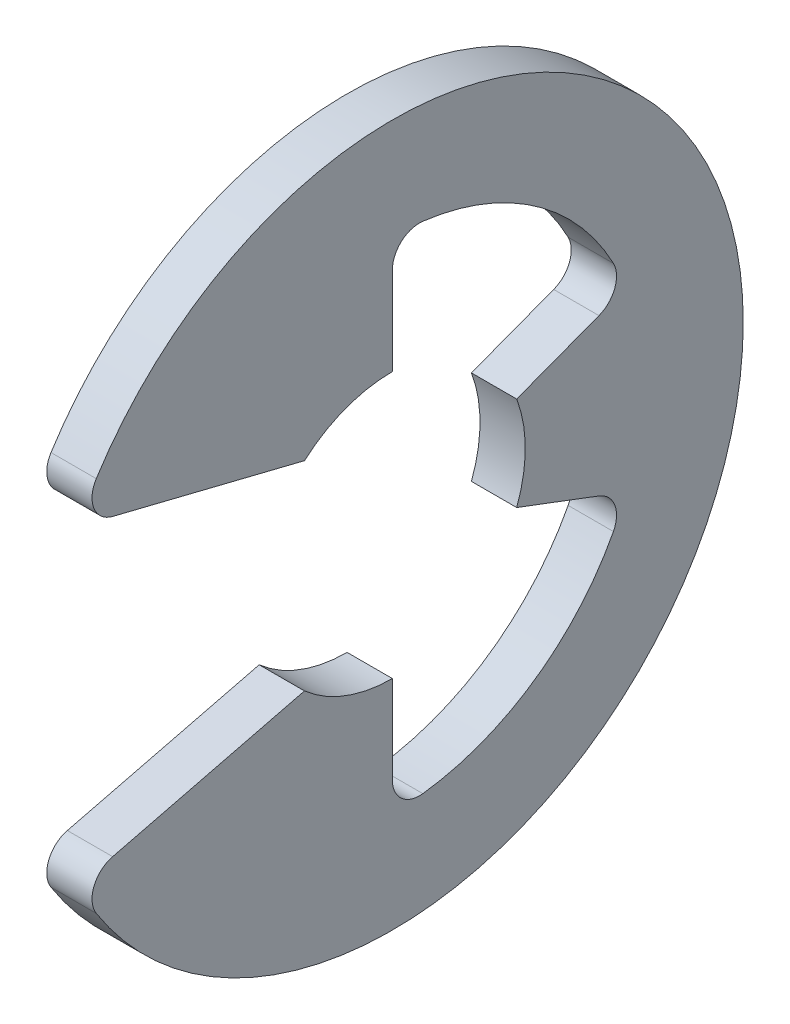
ISO-10303-21;
HEADER;
FILE_DESCRIPTION(('STEP AP214'),'2;1');
FILE_NAME('part.step','',(''),(''),'','','');
FILE_SCHEMA(('AUTOMOTIVE_DESIGN { 1 0 10303 214 1 1 1 1 }'));
ENDSEC;
DATA;
#1=APPLICATION_CONTEXT('core data for automotive mechanical design processes');
#2=APPLICATION_PROTOCOL_DEFINITION('international standard','automotive_design',2000,#1);
#3=PRODUCT_CONTEXT('',#1,'mechanical');
#4=PRODUCT('Part','Part','',(#3));
#5=PRODUCT_RELATED_PRODUCT_CATEGORY('part','',(#4));
#6=PRODUCT_DEFINITION_FORMATION('','',#4);
#7=PRODUCT_DEFINITION_CONTEXT('part definition',#1,'design');
#8=PRODUCT_DEFINITION('design','',#6,#7);
#9=PRODUCT_DEFINITION_SHAPE('','',#8);
#10=(LENGTH_UNIT() NAMED_UNIT(*) SI_UNIT(.MILLI.,.METRE.));
#11=(NAMED_UNIT(*) PLANE_ANGLE_UNIT() SI_UNIT($,.RADIAN.));
#12=(NAMED_UNIT(*) SI_UNIT($,.STERADIAN.) SOLID_ANGLE_UNIT());
#13=UNCERTAINTY_MEASURE_WITH_UNIT(LENGTH_MEASURE(1.E-05),#10,'distance_accuracy_value','');
#14=(GEOMETRIC_REPRESENTATION_CONTEXT(3) GLOBAL_UNCERTAINTY_ASSIGNED_CONTEXT((#13)) GLOBAL_UNIT_ASSIGNED_CONTEXT((#10,
#11,#12)) REPRESENTATION_CONTEXT('',''));
#15=CARTESIAN_POINT('',(0.,0.,0.));
#16=DIRECTION('',(0.,0.,1.));
#17=DIRECTION('',(1.,0.,0.));
#18=AXIS2_PLACEMENT_3D('',#15,#16,#17);
#19=CARTESIAN_POINT('',(0.35,0.,0.));
#20=DIRECTION('',(-1.,0.,0.));
#21=DIRECTION('',(0.,0.,1.));
#22=AXIS2_PLACEMENT_3D('',#19,#20,#21);
#23=CYLINDRICAL_SURFACE('',#22,5.425);
#24=CARTESIAN_POINT('',(0.35,0.,0.));
#25=DIRECTION('',(1.,0.,0.));
#26=DIRECTION('',(0.,0.,-1.));
#27=AXIS2_PLACEMENT_3D('',#24,#25,#26);
#28=CIRCLE('',#27,5.425);
#29=CARTESIAN_POINT('',(0.35,-2.91048609757391,4.57817602062535));
#30=VERTEX_POINT('',#29);
#31=CARTESIAN_POINT('',(0.35,2.91048609757391,4.57817602062535));
#32=VERTEX_POINT('',#31);
#33=EDGE_CURVE('E174',#30,#32,#28,.T.);
#34=ORIENTED_EDGE('',*,*,#33,.F.);
#35=DIRECTION('',(-1.,0.,0.));
#36=VECTOR('',#35,1.);
#37=CARTESIAN_POINT('',(0.35,-2.91048609757391,4.57817602062535));
#38=LINE('',#37,#36);
#39=CARTESIAN_POINT('',(-0.35,-2.91048609757391,4.57817602062535));
#40=VERTEX_POINT('',#39);
#41=EDGE_CURVE('E268',#30,#40,#38,.T.);
#42=ORIENTED_EDGE('',*,*,#41,.T.);
#43=CARTESIAN_POINT('',(-0.35,0.,0.));
#44=DIRECTION('',(1.,0.,0.));
#45=DIRECTION('',(0.,0.,-1.));
#46=AXIS2_PLACEMENT_3D('',#43,#44,#45);
#47=CIRCLE('',#46,5.425);
#48=CARTESIAN_POINT('',(-0.35,2.91048609757391,4.57817602062535));
#49=VERTEX_POINT('',#48);
#50=EDGE_CURVE('E212',#40,#49,#47,.T.);
#51=ORIENTED_EDGE('',*,*,#50,.T.);
#52=DIRECTION('',(-1.,0.,0.));
#53=VECTOR('',#52,1.);
#54=CARTESIAN_POINT('',(0.35,2.91048609757391,4.57817602062535));
#55=LINE('',#54,#53);
#56=EDGE_CURVE('E266',#49,#32,#55,.F.);
#57=ORIENTED_EDGE('',*,*,#56,.T.);
#58=EDGE_LOOP('',(#34,#42,#51,#57));
#59=FACE_BOUND('',#58,.T.);
#60=ADVANCED_FACE('F36',(#59),#23,.T.);
#61=CARTESIAN_POINT('',(0.35,2.41039731260291,4.86010388730495));
#62=DIRECTION('',(0.,0.970536829925373,-0.240952820606874));
#63=DIRECTION('',(0.,0.240952820606874,0.970536829925373));
#64=AXIS2_PLACEMENT_3D('',#61,#62,#63);
#65=PLANE('',#64);
#66=DIRECTION('',(0.,-0.240952820606874,-0.970536829925373));
#67=VECTOR('',#66,1.);
#68=CARTESIAN_POINT('',(0.35,2.41039731260291,4.86010388730495));
#69=LINE('',#68,#67);
#70=CARTESIAN_POINT('',(0.35,2.27753267306405,4.32493677142537));
#71=VERTEX_POINT('',#70);
#72=CARTESIAN_POINT('',(0.35,1.54125,1.35925473605943));
#73=VERTEX_POINT('',#72);
#74=EDGE_CURVE('E160',#71,#73,#69,.T.);
#75=ORIENTED_EDGE('',*,*,#74,.F.);
#76=DIRECTION('',(-1.,0.,0.));
#77=VECTOR('',#76,1.);
#78=CARTESIAN_POINT('',(0.35,2.27753267306405,4.32493677142537));
#79=LINE('',#78,#77);
#80=CARTESIAN_POINT('',(-0.35,2.27753267306405,4.32493677142537));
#81=VERTEX_POINT('',#80);
#82=EDGE_CURVE('E280',#71,#81,#79,.T.);
#83=ORIENTED_EDGE('',*,*,#82,.T.);
#84=DIRECTION('',(0.,-0.240952820606874,-0.970536829925373));
#85=VECTOR('',#84,1.);
#86=CARTESIAN_POINT('',(-0.35,2.41039731260291,4.86010388730495));
#87=LINE('',#86,#85);
#88=CARTESIAN_POINT('',(-0.35,1.54125,1.35925473605943));
#89=VERTEX_POINT('',#88);
#90=EDGE_CURVE('E180',#81,#89,#87,.T.);
#91=ORIENTED_EDGE('',*,*,#90,.T.);
#92=DIRECTION('',(-1.,0.,0.));
#93=VECTOR('',#92,1.);
#94=CARTESIAN_POINT('',(0.35,1.54125,1.35925473605943));
#95=LINE('',#94,#93);
#96=EDGE_CURVE('E177',#73,#89,#95,.T.);
#97=ORIENTED_EDGE('',*,*,#96,.F.);
#98=EDGE_LOOP('',(#75,#83,#91,#97));
#99=FACE_BOUND('',#98,.T.);
#100=ADVANCED_FACE('F178',(#99),#65,.F.);
#101=CARTESIAN_POINT('',(0.35,0.,0.));
#102=DIRECTION('',(-1.,0.,0.));
#103=DIRECTION('',(0.,0.,1.));
#104=AXIS2_PLACEMENT_3D('',#101,#102,#103);
#105=CYLINDRICAL_SURFACE('',#104,2.055);
#106=CARTESIAN_POINT('',(-0.35,0.,0.));
#107=DIRECTION('',(-1.,0.,0.));
#108=DIRECTION('',(0.,0.,1.));
#109=AXIS2_PLACEMENT_3D('',#106,#107,#108);
#110=CIRCLE('',#109,2.055);
#111=CARTESIAN_POINT('',(-0.35,2.055,0.));
#112=VERTEX_POINT('',#111);
#113=EDGE_CURVE('E216',#89,#112,#110,.T.);
#114=ORIENTED_EDGE('',*,*,#113,.T.);
#115=DIRECTION('',(-1.,0.,0.));
#116=VECTOR('',#115,1.);
#117=CARTESIAN_POINT('',(0.35,2.055,0.));
#118=LINE('',#117,#116);
#119=CARTESIAN_POINT('',(0.35,2.055,0.));
#120=VERTEX_POINT('',#119);
#121=EDGE_CURVE('E184',#120,#112,#118,.T.);
#122=ORIENTED_EDGE('',*,*,#121,.F.);
#123=CARTESIAN_POINT('',(0.35,0.,0.));
#124=DIRECTION('',(-1.,0.,0.));
#125=DIRECTION('',(0.,0.,1.));
#126=AXIS2_PLACEMENT_3D('',#123,#124,#125);
#127=CIRCLE('',#126,2.055);
#128=EDGE_CURVE('E166',#73,#120,#127,.T.);
#129=ORIENTED_EDGE('',*,*,#128,.F.);
#130=ORIENTED_EDGE('',*,*,#96,.T.);
#131=EDGE_LOOP('',(#114,#122,#129,#130));
#132=FACE_BOUND('',#131,.T.);
#133=ADVANCED_FACE('F186',(#132),#105,.F.);
#134=CARTESIAN_POINT('',(0.35,2.055,0.));
#135=DIRECTION('',(0.,0.,1.));
#136=DIRECTION('',(0.,-1.,0.));
#137=AXIS2_PLACEMENT_3D('',#134,#135,#136);
#138=PLANE('',#137);
#139=DIRECTION('',(0.,1.,0.));
#140=VECTOR('',#139,1.);
#141=CARTESIAN_POINT('',(-0.35,2.055,0.));
#142=LINE('',#141,#140);
#143=CARTESIAN_POINT('',(-0.35,3.41491421940735,0.));
#144=VERTEX_POINT('',#143);
#145=EDGE_CURVE('E218',#112,#144,#142,.T.);
#146=ORIENTED_EDGE('',*,*,#145,.T.);
#147=DIRECTION('',(1.,0.,0.));
#148=VECTOR('',#147,1.);
#149=CARTESIAN_POINT('',(0.35,3.41491421940735,0.));
#150=LINE('',#149,#148);
#151=CARTESIAN_POINT('',(0.35,3.41491421940735,0.));
#152=VERTEX_POINT('',#151);
#153=EDGE_CURVE('E264',#144,#152,#150,.T.);
#154=ORIENTED_EDGE('',*,*,#153,.T.);
#155=DIRECTION('',(0.,1.,0.));
#156=VECTOR('',#155,1.);
#157=CARTESIAN_POINT('',(0.35,2.055,0.));
#158=LINE('',#157,#156);
#159=EDGE_CURVE('E189',#120,#152,#158,.T.);
#160=ORIENTED_EDGE('',*,*,#159,.F.);
#161=ORIENTED_EDGE('',*,*,#121,.T.);
#162=EDGE_LOOP('',(#146,#154,#160,#161));
#163=FACE_BOUND('',#162,.T.);
#164=ADVANCED_FACE('F386',(#163),#138,.F.);
#165=CARTESIAN_POINT('',(0.35,0.,0.));
#166=DIRECTION('',(-1.,0.,0.));
#167=DIRECTION('',(0.,0.,1.));
#168=AXIS2_PLACEMENT_3D('',#165,#166,#167);
#169=CYLINDRICAL_SURFACE('',#168,3.86064516129032);
#170=CARTESIAN_POINT('',(0.35,0.,0.));
#171=DIRECTION('',(-1.,0.,0.));
#172=DIRECTION('',(0.,0.,-1.));
#173=AXIS2_PLACEMENT_3D('',#170,#171,#172);
#174=CIRCLE('',#173,3.86064516129032);
#175=CARTESIAN_POINT('',(0.35,3.83177324000255,-0.471269454340894));
#176=VERTEX_POINT('',#175);
#177=CARTESIAN_POINT('',(0.35,1.79556862973636,-3.4176767485093));
#178=VERTEX_POINT('',#177);
#179=EDGE_CURVE('E191',#176,#178,#174,.T.);
#180=ORIENTED_EDGE('',*,*,#179,.F.);
#181=DIRECTION('',(-1.,0.,0.));
#182=VECTOR('',#181,1.);
#183=CARTESIAN_POINT('',(0.35,3.83177324000255,-0.471269454340894));
#184=LINE('',#183,#182);
#185=CARTESIAN_POINT('',(-0.35,3.83177324000255,-0.471269454340894));
#186=VERTEX_POINT('',#185);
#187=EDGE_CURVE('E261',#176,#186,#184,.T.);
#188=ORIENTED_EDGE('',*,*,#187,.T.);
#189=CARTESIAN_POINT('',(-0.35,0.,0.));
#190=DIRECTION('',(-1.,0.,0.));
#191=DIRECTION('',(0.,0.,-1.));
#192=AXIS2_PLACEMENT_3D('',#189,#190,#191);
#193=CIRCLE('',#192,3.86064516129032);
#194=CARTESIAN_POINT('',(-0.35,1.79556862973636,-3.4176767485093));
#195=VERTEX_POINT('',#194);
#196=EDGE_CURVE('E221',#186,#195,#193,.T.);
#197=ORIENTED_EDGE('',*,*,#196,.T.);
#198=DIRECTION('',(-1.,0.,0.));
#199=VECTOR('',#198,1.);
#200=CARTESIAN_POINT('',(0.35,1.79556862973636,-3.4176767485093));
#201=LINE('',#200,#199);
#202=EDGE_CURVE('E259',#195,#178,#201,.F.);
#203=ORIENTED_EDGE('',*,*,#202,.T.);
#204=EDGE_LOOP('',(#180,#188,#197,#203));
#205=FACE_BOUND('',#204,.T.);
#206=ADVANCED_FACE('F308',(#205),#169,.F.);
#207=CARTESIAN_POINT('',(0.35,0.726552217669176,-1.92227648245511));
#208=DIRECTION('',(0.,-0.935414346693485,-0.353553390593275));
#209=DIRECTION('',(0.,0.353553390593275,-0.935414346693485));
#210=AXIS2_PLACEMENT_3D('',#207,#208,#209);
#211=PLANE('',#210);
#212=DIRECTION('',(0.,-0.353553390593275,0.935414346693485));
#213=VECTOR('',#212,1.);
#214=CARTESIAN_POINT('',(0.35,0.726552217669176,-1.92227648245511));
#215=LINE('',#214,#213);
#216=CARTESIAN_POINT('',(0.35,1.20735450085665,-3.19435975356122));
#217=VERTEX_POINT('',#216);
#218=CARTESIAN_POINT('',(0.35,0.726552217669177,-1.92227648245511));
#219=VERTEX_POINT('',#218);
#220=EDGE_CURVE('E196',#217,#219,#215,.T.);
#221=ORIENTED_EDGE('',*,*,#220,.F.);
#222=DIRECTION('',(1.,0.,0.));
#223=VECTOR('',#222,1.);
#224=CARTESIAN_POINT('',(-0.35,1.20735450085665,-3.19435975356122));
#225=LINE('',#224,#223);
#226=CARTESIAN_POINT('',(-0.35,1.20735450085665,-3.19435975356122));
#227=VERTEX_POINT('',#226);
#228=EDGE_CURVE('E283',#217,#227,#225,.F.);
#229=ORIENTED_EDGE('',*,*,#228,.T.);
#230=DIRECTION('',(0.,-0.353553390593275,0.935414346693485));
#231=VECTOR('',#230,1.);
#232=CARTESIAN_POINT('',(-0.35,0.726552217669176,-1.92227648245511));
#233=LINE('',#232,#231);
#234=CARTESIAN_POINT('',(-0.35,0.726552217669177,-1.92227648245511));
#235=VERTEX_POINT('',#234);
#236=EDGE_CURVE('E224',#227,#235,#233,.T.);
#237=ORIENTED_EDGE('',*,*,#236,.T.);
#238=DIRECTION('',(-1.,0.,0.));
#239=VECTOR('',#238,1.);
#240=CARTESIAN_POINT('',(0.35,0.726552217669177,-1.92227648245511));
#241=LINE('',#240,#239);
#242=EDGE_CURVE('E248',#219,#235,#241,.T.);
#243=ORIENTED_EDGE('',*,*,#242,.F.);
#244=EDGE_LOOP('',(#221,#229,#237,#243));
#245=FACE_BOUND('',#244,.T.);
#246=ADVANCED_FACE('F311',(#245),#211,.F.);
#247=CARTESIAN_POINT('',(0.35,0.,0.));
#248=DIRECTION('',(-1.,0.,0.));
#249=DIRECTION('',(0.,0.,1.));
#250=AXIS2_PLACEMENT_3D('',#247,#248,#249);
#251=CYLINDRICAL_SURFACE('',#250,2.055);
#252=CARTESIAN_POINT('',(-0.35,0.,0.));
#253=DIRECTION('',(-1.,0.,0.));
#254=DIRECTION('',(0.,0.,1.));
#255=AXIS2_PLACEMENT_3D('',#252,#253,#254);
#256=CIRCLE('',#255,2.055);
#257=CARTESIAN_POINT('',(-0.35,-0.726552217669176,-1.92227648245511));
#258=VERTEX_POINT('',#257);
#259=EDGE_CURVE('E226',#235,#258,#256,.T.);
#260=ORIENTED_EDGE('',*,*,#259,.T.);
#261=DIRECTION('',(-1.,0.,0.));
#262=VECTOR('',#261,1.);
#263=CARTESIAN_POINT('',(0.35,-0.726552217669176,-1.92227648245511));
#264=LINE('',#263,#262);
#265=CARTESIAN_POINT('',(0.35,-0.726552217669176,-1.92227648245511));
#266=VERTEX_POINT('',#265);
#267=EDGE_CURVE('E245',#266,#258,#264,.T.);
#268=ORIENTED_EDGE('',*,*,#267,.F.);
#269=CARTESIAN_POINT('',(0.35,0.,0.));
#270=DIRECTION('',(-1.,0.,0.));
#271=DIRECTION('',(0.,0.,1.));
#272=AXIS2_PLACEMENT_3D('',#269,#270,#271);
#273=CIRCLE('',#272,2.055);
#274=EDGE_CURVE('E198',#219,#266,#273,.T.);
#275=ORIENTED_EDGE('',*,*,#274,.F.);
#276=ORIENTED_EDGE('',*,*,#242,.T.);
#277=EDGE_LOOP('',(#260,#268,#275,#276));
#278=FACE_BOUND('',#277,.T.);
#279=ADVANCED_FACE('F317',(#278),#251,.F.);
#280=CARTESIAN_POINT('',(0.35,-0.726552217669176,-1.92227648245511));
#281=DIRECTION('',(0.,0.935414346693485,-0.353553390593275));
#282=DIRECTION('',(0.,0.353553390593275,0.935414346693485));
#283=AXIS2_PLACEMENT_3D('',#280,#281,#282);
#284=PLANE('',#283);
#285=DIRECTION('',(0.,-0.353553390593275,-0.935414346693485));
#286=VECTOR('',#285,1.);
#287=CARTESIAN_POINT('',(-0.35,-0.726552217669176,-1.92227648245511));
#288=LINE('',#287,#286);
#289=CARTESIAN_POINT('',(-0.35,-1.20735450085665,-3.19435975356122));
#290=VERTEX_POINT('',#289);
#291=EDGE_CURVE('E228',#258,#290,#288,.T.);
#292=ORIENTED_EDGE('',*,*,#291,.T.);
#293=DIRECTION('',(1.,0.,0.));
#294=VECTOR('',#293,1.);
#295=CARTESIAN_POINT('',(0.35,-1.20735450085665,-3.19435975356122));
#296=LINE('',#295,#294);
#297=CARTESIAN_POINT('',(0.35,-1.20735450085665,-3.19435975356122));
#298=VERTEX_POINT('',#297);
#299=EDGE_CURVE('E51',#290,#298,#296,.T.);
#300=ORIENTED_EDGE('',*,*,#299,.T.);
#301=DIRECTION('',(0.,-0.353553390593275,-0.935414346693485));
#302=VECTOR('',#301,1.);
#303=CARTESIAN_POINT('',(0.35,-0.726552217669176,-1.92227648245511));
#304=LINE('',#303,#302);
#305=EDGE_CURVE('E200',#266,#298,#304,.T.);
#306=ORIENTED_EDGE('',*,*,#305,.F.);
#307=ORIENTED_EDGE('',*,*,#267,.T.);
#308=EDGE_LOOP('',(#292,#300,#306,#307));
#309=FACE_BOUND('',#308,.T.);
#310=ADVANCED_FACE('F319',(#309),#284,.F.);
#311=CARTESIAN_POINT('',(0.35,0.,0.));
#312=DIRECTION('',(-1.,0.,0.));
#313=DIRECTION('',(0.,0.,1.));
#314=AXIS2_PLACEMENT_3D('',#311,#312,#313);
#315=CYLINDRICAL_SURFACE('',#314,3.86064516129032);
#316=CARTESIAN_POINT('',(-0.35,0.,0.));
#317=DIRECTION('',(-1.,0.,0.));
#318=DIRECTION('',(0.,0.,-1.));
#319=AXIS2_PLACEMENT_3D('',#316,#317,#318);
#320=CIRCLE('',#319,3.86064516129032);
#321=CARTESIAN_POINT('',(-0.35,-1.79556862973636,-3.4176767485093));
#322=VERTEX_POINT('',#321);
#323=CARTESIAN_POINT('',(-0.35,-3.83177324000255,-0.471269454340895));
#324=VERTEX_POINT('',#323);
#325=EDGE_CURVE('E230',#322,#324,#320,.T.);
#326=ORIENTED_EDGE('',*,*,#325,.T.);
#327=DIRECTION('',(-1.,0.,0.));
#328=VECTOR('',#327,1.);
#329=CARTESIAN_POINT('',(0.35,-3.83177324000255,-0.471269454340895));
#330=LINE('',#329,#328);
#331=CARTESIAN_POINT('',(0.35,-3.83177324000255,-0.471269454340895));
#332=VERTEX_POINT('',#331);
#333=EDGE_CURVE('E257',#324,#332,#330,.F.);
#334=ORIENTED_EDGE('',*,*,#333,.T.);
#335=CARTESIAN_POINT('',(0.35,0.,0.));
#336=DIRECTION('',(-1.,0.,0.));
#337=DIRECTION('',(0.,0.,-1.));
#338=AXIS2_PLACEMENT_3D('',#335,#336,#337);
#339=CIRCLE('',#338,3.86064516129032);
#340=CARTESIAN_POINT('',(0.35,-1.79556862973636,-3.4176767485093));
#341=VERTEX_POINT('',#340);
#342=EDGE_CURVE('E202',#341,#332,#339,.T.);
#343=ORIENTED_EDGE('',*,*,#342,.F.);
#344=DIRECTION('',(-1.,0.,0.));
#345=VECTOR('',#344,1.);
#346=CARTESIAN_POINT('',(0.35,-1.79556862973636,-3.4176767485093));
#347=LINE('',#346,#345);
#348=EDGE_CURVE('E254',#341,#322,#347,.T.);
#349=ORIENTED_EDGE('',*,*,#348,.T.);
#350=EDGE_LOOP('',(#326,#334,#343,#349));
#351=FACE_BOUND('',#350,.T.);
#352=ADVANCED_FACE('F321',(#351),#315,.F.);
#353=CARTESIAN_POINT('',(0.35,-2.055,0.));
#354=DIRECTION('',(0.,0.,1.));
#355=DIRECTION('',(0.,-1.,0.));
#356=AXIS2_PLACEMENT_3D('',#353,#354,#355);
#357=PLANE('',#356);
#358=DIRECTION('',(0.,1.,0.));
#359=VECTOR('',#358,1.);
#360=CARTESIAN_POINT('',(0.35,-2.055,0.));
#361=LINE('',#360,#359);
#362=CARTESIAN_POINT('',(0.35,-3.41491421940735,0.));
#363=VERTEX_POINT('',#362);
#364=CARTESIAN_POINT('',(0.35,-2.055,0.));
#365=VERTEX_POINT('',#364);
#366=EDGE_CURVE('E205',#363,#365,#361,.T.);
#367=ORIENTED_EDGE('',*,*,#366,.F.);
#368=DIRECTION('',(1.,0.,0.));
#369=VECTOR('',#368,1.);
#370=CARTESIAN_POINT('',(-0.35,-3.41491421940735,0.));
#371=LINE('',#370,#369);
#372=CARTESIAN_POINT('',(-0.35,-3.41491421940735,0.));
#373=VERTEX_POINT('',#372);
#374=EDGE_CURVE('E183',#363,#373,#371,.F.);
#375=ORIENTED_EDGE('',*,*,#374,.T.);
#376=DIRECTION('',(0.,1.,0.));
#377=VECTOR('',#376,1.);
#378=CARTESIAN_POINT('',(-0.35,-2.055,0.));
#379=LINE('',#378,#377);
#380=CARTESIAN_POINT('',(-0.35,-2.055,0.));
#381=VERTEX_POINT('',#380);
#382=EDGE_CURVE('E233',#373,#381,#379,.T.);
#383=ORIENTED_EDGE('',*,*,#382,.T.);
#384=DIRECTION('',(-1.,0.,0.));
#385=VECTOR('',#384,1.);
#386=CARTESIAN_POINT('',(0.35,-2.055,0.));
#387=LINE('',#386,#385);
#388=EDGE_CURVE('E242',#365,#381,#387,.T.);
#389=ORIENTED_EDGE('',*,*,#388,.F.);
#390=EDGE_LOOP('',(#367,#375,#383,#389));
#391=FACE_BOUND('',#390,.T.);
#392=ADVANCED_FACE('F327',(#391),#357,.F.);
#393=CARTESIAN_POINT('',(0.35,0.,0.));
#394=DIRECTION('',(-1.,0.,0.));
#395=DIRECTION('',(0.,0.,1.));
#396=AXIS2_PLACEMENT_3D('',#393,#394,#395);
#397=CYLINDRICAL_SURFACE('',#396,2.055);
#398=CARTESIAN_POINT('',(-0.35,0.,0.));
#399=DIRECTION('',(-1.,0.,0.));
#400=DIRECTION('',(0.,0.,-1.));
#401=AXIS2_PLACEMENT_3D('',#398,#399,#400);
#402=CIRCLE('',#401,2.055);
#403=CARTESIAN_POINT('',(-0.35,-1.54125,1.35925473605943));
#404=VERTEX_POINT('',#403);
#405=EDGE_CURVE('E235',#381,#404,#402,.T.);
#406=ORIENTED_EDGE('',*,*,#405,.T.);
#407=DIRECTION('',(-1.,0.,0.));
#408=VECTOR('',#407,1.);
#409=CARTESIAN_POINT('',(0.35,-1.54125,1.35925473605943));
#410=LINE('',#409,#408);
#411=CARTESIAN_POINT('',(0.35,-1.54125,1.35925473605943));
#412=VERTEX_POINT('',#411);
#413=EDGE_CURVE('E211',#412,#404,#410,.T.);
#414=ORIENTED_EDGE('',*,*,#413,.F.);
#415=CARTESIAN_POINT('',(0.35,0.,0.));
#416=DIRECTION('',(-1.,0.,0.));
#417=DIRECTION('',(0.,0.,-1.));
#418=AXIS2_PLACEMENT_3D('',#415,#416,#417);
#419=CIRCLE('',#418,2.055);
#420=EDGE_CURVE('E207',#365,#412,#419,.T.);
#421=ORIENTED_EDGE('',*,*,#420,.F.);
#422=ORIENTED_EDGE('',*,*,#388,.T.);
#423=EDGE_LOOP('',(#406,#414,#421,#422));
#424=FACE_BOUND('',#423,.T.);
#425=ADVANCED_FACE('F376',(#424),#397,.F.);
#426=CARTESIAN_POINT('',(0.35,-2.41039731260291,4.86010388730495));
#427=DIRECTION('',(0.,-0.970536829925373,-0.240952820606874));
#428=DIRECTION('',(0.,0.240952820606874,-0.970536829925373));
#429=AXIS2_PLACEMENT_3D('',#426,#427,#428);
#430=PLANE('',#429);
#431=DIRECTION('',(0.,-0.240952820606874,0.970536829925373));
#432=VECTOR('',#431,1.);
#433=CARTESIAN_POINT('',(-0.35,-2.41039731260291,4.86010388730495));
#434=LINE('',#433,#432);
#435=CARTESIAN_POINT('',(-0.35,-2.27753267306405,4.32493677142537));
#436=VERTEX_POINT('',#435);
#437=EDGE_CURVE('E237',#404,#436,#434,.T.);
#438=ORIENTED_EDGE('',*,*,#437,.T.);
#439=DIRECTION('',(-1.,0.,0.));
#440=VECTOR('',#439,1.);
#441=CARTESIAN_POINT('',(0.35,-2.27753267306405,4.32493677142537));
#442=LINE('',#441,#440);
#443=CARTESIAN_POINT('',(0.35,-2.27753267306405,4.32493677142537));
#444=VERTEX_POINT('',#443);
#445=EDGE_CURVE('E275',#436,#444,#442,.F.);
#446=ORIENTED_EDGE('',*,*,#445,.T.);
#447=DIRECTION('',(0.,-0.240952820606874,0.970536829925373));
#448=VECTOR('',#447,1.);
#449=CARTESIAN_POINT('',(0.35,-2.41039731260291,4.86010388730495));
#450=LINE('',#449,#448);
#451=EDGE_CURVE('E209',#412,#444,#450,.T.);
#452=ORIENTED_EDGE('',*,*,#451,.F.);
#453=ORIENTED_EDGE('',*,*,#413,.T.);
#454=EDGE_LOOP('',(#438,#446,#452,#453));
#455=FACE_BOUND('',#454,.T.);
#456=ADVANCED_FACE('F418',(#455),#430,.F.);
#457=CARTESIAN_POINT('',(0.35,0.,0.));
#458=DIRECTION('',(1.,0.,0.));
#459=DIRECTION('',(0.,0.,-1.));
#460=AXIS2_PLACEMENT_3D('',#457,#458,#459);
#461=PLANE('',#460);
#462=ORIENTED_EDGE('',*,*,#451,.T.);
#463=CARTESIAN_POINT('',(0.35,-2.6851581416327,4.22373658677049));
#464=DIRECTION('',(1.,0.,0.));
#465=DIRECTION('',(0.,0.,-1.));
#466=AXIS2_PLACEMENT_3D('',#463,#464,#465);
#467=CIRCLE('',#466,0.42);
#468=EDGE_CURVE('E278',#444,#30,#467,.T.);
#469=ORIENTED_EDGE('',*,*,#468,.T.);
#470=ORIENTED_EDGE('',*,*,#33,.T.);
#471=CARTESIAN_POINT('',(0.35,2.6851581416327,4.22373658677049));
#472=DIRECTION('',(1.,0.,0.));
#473=DIRECTION('',(0.,0.,-1.));
#474=AXIS2_PLACEMENT_3D('',#471,#472,#473);
#475=CIRCLE('',#474,0.42);
#476=EDGE_CURVE('E170',#32,#71,#475,.T.);
#477=ORIENTED_EDGE('',*,*,#476,.T.);
#478=ORIENTED_EDGE('',*,*,#74,.T.);
#479=ORIENTED_EDGE('',*,*,#128,.T.);
#480=ORIENTED_EDGE('',*,*,#159,.T.);
#481=CARTESIAN_POINT('',(0.35,3.41491421940735,-0.419999999999998));
#482=DIRECTION('',(1.,0.,0.));
#483=DIRECTION('',(0.,0.,-1.));
#484=AXIS2_PLACEMENT_3D('',#481,#482,#483);
#485=CIRCLE('',#484,0.42);
#486=EDGE_CURVE('E292',#152,#176,#485,.F.);
#487=ORIENTED_EDGE('',*,*,#486,.T.);
#488=ORIENTED_EDGE('',*,*,#179,.T.);
#489=CARTESIAN_POINT('',(0.35,1.60022852646792,-3.04586732951205));
#490=DIRECTION('',(1.,0.,0.));
#491=DIRECTION('',(0.,0.,-1.));
#492=AXIS2_PLACEMENT_3D('',#489,#490,#491);
#493=CIRCLE('',#492,0.42);
#494=EDGE_CURVE('E11',#178,#217,#493,.F.);
#495=ORIENTED_EDGE('',*,*,#494,.T.);
#496=ORIENTED_EDGE('',*,*,#220,.T.);
#497=ORIENTED_EDGE('',*,*,#274,.T.);
#498=ORIENTED_EDGE('',*,*,#305,.T.);
#499=CARTESIAN_POINT('',(0.35,-1.60022852646792,-3.04586732951205));
#500=DIRECTION('',(1.,0.,0.));
#501=DIRECTION('',(0.,0.,-1.));
#502=AXIS2_PLACEMENT_3D('',#499,#500,#501);
#503=CIRCLE('',#502,0.42);
#504=EDGE_CURVE('E296',#298,#341,#503,.F.);
#505=ORIENTED_EDGE('',*,*,#504,.T.);
#506=ORIENTED_EDGE('',*,*,#342,.T.);
#507=CARTESIAN_POINT('',(0.35,-3.41491421940735,-0.419999999999999));
#508=DIRECTION('',(1.,0.,0.));
#509=DIRECTION('',(0.,0.,-1.));
#510=AXIS2_PLACEMENT_3D('',#507,#508,#509);
#511=CIRCLE('',#510,0.42);
#512=EDGE_CURVE('E288',#332,#363,#511,.F.);
#513=ORIENTED_EDGE('',*,*,#512,.T.);
#514=ORIENTED_EDGE('',*,*,#366,.T.);
#515=ORIENTED_EDGE('',*,*,#420,.T.);
#516=EDGE_LOOP('',(#462,#469,#470,#477,#478,#479,#480,#487,#488,#495,#496,#497,#498,#505,#506,
#513,#514,#515));
#517=FACE_BOUND('',#516,.T.);
#518=ADVANCED_FACE('F163',(#517),#461,.T.);
#519=CARTESIAN_POINT('',(-0.35,0.,0.));
#520=DIRECTION('',(1.,0.,0.));
#521=DIRECTION('',(0.,0.,-1.));
#522=AXIS2_PLACEMENT_3D('',#519,#520,#521);
#523=PLANE('',#522);
#524=ORIENTED_EDGE('',*,*,#50,.F.);
#525=CARTESIAN_POINT('',(-0.35,-2.6851581416327,4.22373658677049));
#526=DIRECTION('',(1.,0.,0.));
#527=DIRECTION('',(0.,0.,-1.));
#528=AXIS2_PLACEMENT_3D('',#525,#526,#527);
#529=CIRCLE('',#528,0.42);
#530=EDGE_CURVE('E273',#40,#436,#529,.F.);
#531=ORIENTED_EDGE('',*,*,#530,.T.);
#532=ORIENTED_EDGE('',*,*,#437,.F.);
#533=ORIENTED_EDGE('',*,*,#405,.F.);
#534=ORIENTED_EDGE('',*,*,#382,.F.);
#535=CARTESIAN_POINT('',(-0.35,-3.41491421940735,-0.419999999999999));
#536=DIRECTION('',(1.,0.,0.));
#537=DIRECTION('',(0.,0.,-1.));
#538=AXIS2_PLACEMENT_3D('',#535,#536,#537);
#539=CIRCLE('',#538,0.42);
#540=EDGE_CURVE('E286',#373,#324,#539,.T.);
#541=ORIENTED_EDGE('',*,*,#540,.T.);
#542=ORIENTED_EDGE('',*,*,#325,.F.);
#543=CARTESIAN_POINT('',(-0.35,-1.60022852646792,-3.04586732951205));
#544=DIRECTION('',(1.,0.,0.));
#545=DIRECTION('',(0.,0.,-1.));
#546=AXIS2_PLACEMENT_3D('',#543,#544,#545);
#547=CIRCLE('',#546,0.42);
#548=EDGE_CURVE('E294',#322,#290,#547,.T.);
#549=ORIENTED_EDGE('',*,*,#548,.T.);
#550=ORIENTED_EDGE('',*,*,#291,.F.);
#551=ORIENTED_EDGE('',*,*,#259,.F.);
#552=ORIENTED_EDGE('',*,*,#236,.F.);
#553=CARTESIAN_POINT('',(-0.35,1.60022852646792,-3.04586732951205));
#554=DIRECTION('',(1.,0.,0.));
#555=DIRECTION('',(0.,0.,-1.));
#556=AXIS2_PLACEMENT_3D('',#553,#554,#555);
#557=CIRCLE('',#556,0.42);
#558=EDGE_CURVE('E44',#227,#195,#557,.T.);
#559=ORIENTED_EDGE('',*,*,#558,.T.);
#560=ORIENTED_EDGE('',*,*,#196,.F.);
#561=CARTESIAN_POINT('',(-0.35,3.41491421940735,-0.419999999999998));
#562=DIRECTION('',(1.,0.,0.));
#563=DIRECTION('',(0.,0.,-1.));
#564=AXIS2_PLACEMENT_3D('',#561,#562,#563);
#565=CIRCLE('',#564,0.42);
#566=EDGE_CURVE('E290',#186,#144,#565,.T.);
#567=ORIENTED_EDGE('',*,*,#566,.T.);
#568=ORIENTED_EDGE('',*,*,#145,.F.);
#569=ORIENTED_EDGE('',*,*,#113,.F.);
#570=ORIENTED_EDGE('',*,*,#90,.F.);
#571=CARTESIAN_POINT('',(-0.35,2.6851581416327,4.22373658677049));
#572=DIRECTION('',(1.,0.,0.));
#573=DIRECTION('',(0.,0.,-1.));
#574=AXIS2_PLACEMENT_3D('',#571,#572,#573);
#575=CIRCLE('',#574,0.42);
#576=EDGE_CURVE('E271',#81,#49,#575,.F.);
#577=ORIENTED_EDGE('',*,*,#576,.T.);
#578=EDGE_LOOP('',(#524,#531,#532,#533,#534,#541,#542,#549,#550,#551,#552,#559,#560,#567,#568,
#569,#570,#577));
#579=FACE_BOUND('',#578,.T.);
#580=ADVANCED_FACE('F301',(#579),#523,.F.);
#581=CARTESIAN_POINT('',(0.35,-3.41491421940735,-0.419999999999999));
#582=DIRECTION('',(-1.,0.,0.));
#583=DIRECTION('',(0.,0.,1.));
#584=AXIS2_PLACEMENT_3D('',#581,#582,#583);
#585=CYLINDRICAL_SURFACE('',#584,0.42);
#586=ORIENTED_EDGE('',*,*,#512,.F.);
#587=ORIENTED_EDGE('',*,*,#333,.F.);
#588=ORIENTED_EDGE('',*,*,#540,.F.);
#589=ORIENTED_EDGE('',*,*,#374,.F.);
#590=EDGE_LOOP('',(#586,#587,#588,#589));
#591=FACE_BOUND('',#590,.T.);
#592=ADVANCED_FACE('F341',(#591),#585,.F.);
#593=CARTESIAN_POINT('',(0.35,3.41491421940735,-0.419999999999998));
#594=DIRECTION('',(-1.,0.,0.));
#595=DIRECTION('',(0.,0.,1.));
#596=AXIS2_PLACEMENT_3D('',#593,#594,#595);
#597=CYLINDRICAL_SURFACE('',#596,0.42);
#598=ORIENTED_EDGE('',*,*,#486,.F.);
#599=ORIENTED_EDGE('',*,*,#153,.F.);
#600=ORIENTED_EDGE('',*,*,#566,.F.);
#601=ORIENTED_EDGE('',*,*,#187,.F.);
#602=EDGE_LOOP('',(#598,#599,#600,#601));
#603=FACE_BOUND('',#602,.T.);
#604=ADVANCED_FACE('F344',(#603),#597,.F.);
#605=CARTESIAN_POINT('',(0.35,-2.6851581416327,4.22373658677049));
#606=DIRECTION('',(-1.,0.,0.));
#607=DIRECTION('',(0.,0.,1.));
#608=AXIS2_PLACEMENT_3D('',#605,#606,#607);
#609=CYLINDRICAL_SURFACE('',#608,0.42);
#610=ORIENTED_EDGE('',*,*,#468,.F.);
#611=ORIENTED_EDGE('',*,*,#445,.F.);
#612=ORIENTED_EDGE('',*,*,#530,.F.);
#613=ORIENTED_EDGE('',*,*,#41,.F.);
#614=EDGE_LOOP('',(#610,#611,#612,#613));
#615=FACE_BOUND('',#614,.T.);
#616=ADVANCED_FACE('F348',(#615),#609,.T.);
#617=CARTESIAN_POINT('',(0.35,2.6851581416327,4.22373658677049));
#618=DIRECTION('',(-1.,0.,0.));
#619=DIRECTION('',(0.,0.,1.));
#620=AXIS2_PLACEMENT_3D('',#617,#618,#619);
#621=CYLINDRICAL_SURFACE('',#620,0.42);
#622=ORIENTED_EDGE('',*,*,#476,.F.);
#623=ORIENTED_EDGE('',*,*,#56,.F.);
#624=ORIENTED_EDGE('',*,*,#576,.F.);
#625=ORIENTED_EDGE('',*,*,#82,.F.);
#626=EDGE_LOOP('',(#622,#623,#624,#625));
#627=FACE_BOUND('',#626,.T.);
#628=ADVANCED_FACE('F352',(#627),#621,.T.);
#629=CARTESIAN_POINT('',(0.35,-1.60022852646792,-3.04586732951205));
#630=DIRECTION('',(-1.,0.,0.));
#631=DIRECTION('',(0.,0.,1.));
#632=AXIS2_PLACEMENT_3D('',#629,#630,#631);
#633=CYLINDRICAL_SURFACE('',#632,0.42);
#634=ORIENTED_EDGE('',*,*,#504,.F.);
#635=ORIENTED_EDGE('',*,*,#299,.F.);
#636=ORIENTED_EDGE('',*,*,#548,.F.);
#637=ORIENTED_EDGE('',*,*,#348,.F.);
#638=EDGE_LOOP('',(#634,#635,#636,#637));
#639=FACE_BOUND('',#638,.T.);
#640=ADVANCED_FACE('F355',(#639),#633,.F.);
#641=CARTESIAN_POINT('',(0.35,1.60022852646792,-3.04586732951205));
#642=DIRECTION('',(-1.,0.,0.));
#643=DIRECTION('',(0.,0.,1.));
#644=AXIS2_PLACEMENT_3D('',#641,#642,#643);
#645=CYLINDRICAL_SURFACE('',#644,0.42);
#646=ORIENTED_EDGE('',*,*,#494,.F.);
#647=ORIENTED_EDGE('',*,*,#202,.F.);
#648=ORIENTED_EDGE('',*,*,#558,.F.);
#649=ORIENTED_EDGE('',*,*,#228,.F.);
#650=EDGE_LOOP('',(#646,#647,#648,#649));
#651=FACE_BOUND('',#650,.T.);
#652=ADVANCED_FACE('F38',(#651),#645,.F.);
#653=CLOSED_SHELL('',(#60,#100,#133,#164,#206,#246,#279,#310,#352,#392,#425,#456,#518,#580,#592,
#604,#616,#628,#640,#652));
#654=MANIFOLD_SOLID_BREP('B2',#653);
#655=ADVANCED_BREP_SHAPE_REPRESENTATION('',(#18,#654),#14);
#656=SHAPE_DEFINITION_REPRESENTATION(#9,#655);
ENDSEC;
END-ISO-10303-21;
